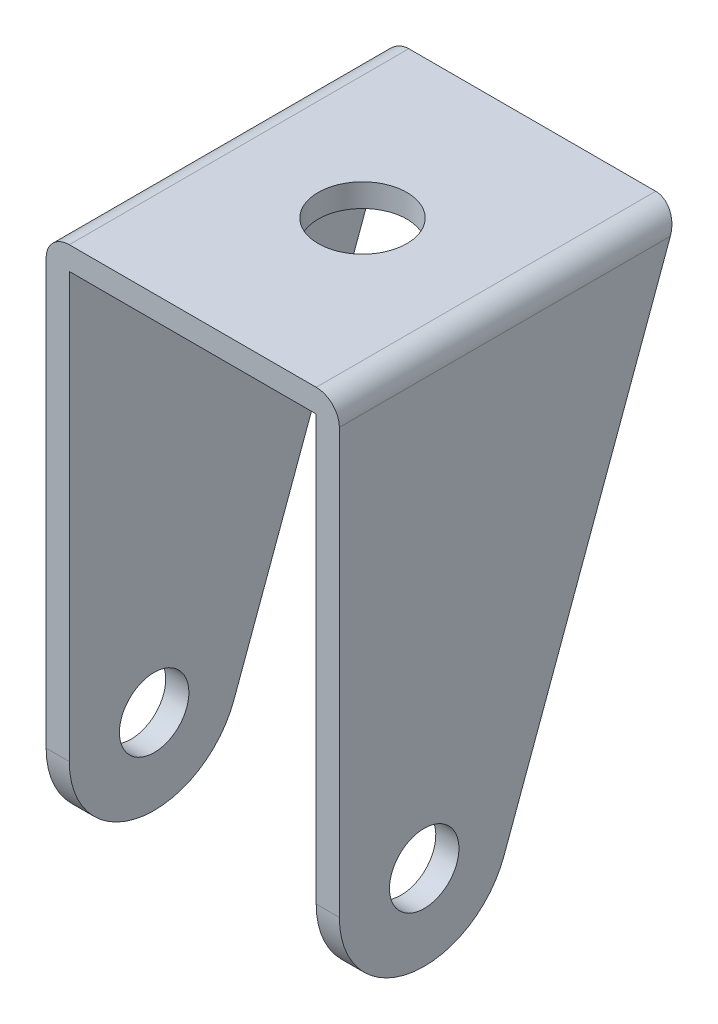
ISO-10303-21;
HEADER;
FILE_DESCRIPTION(('STEP AP214'),'2;1');
FILE_NAME('part.step','',(''),(''),'','','');
FILE_SCHEMA(('AUTOMOTIVE_DESIGN { 1 0 10303 214 1 1 1 1 }'));
ENDSEC;
DATA;
#1=APPLICATION_CONTEXT('core data for automotive mechanical design processes');
#2=APPLICATION_PROTOCOL_DEFINITION('international standard','automotive_design',2000,#1);
#3=PRODUCT_CONTEXT('',#1,'mechanical');
#4=PRODUCT('Part','Part','',(#3));
#5=PRODUCT_RELATED_PRODUCT_CATEGORY('part','',(#4));
#6=PRODUCT_DEFINITION_FORMATION('','',#4);
#7=PRODUCT_DEFINITION_CONTEXT('part definition',#1,'design');
#8=PRODUCT_DEFINITION('design','',#6,#7);
#9=PRODUCT_DEFINITION_SHAPE('','',#8);
#10=(LENGTH_UNIT() NAMED_UNIT(*) SI_UNIT(.MILLI.,.METRE.));
#11=(NAMED_UNIT(*) PLANE_ANGLE_UNIT() SI_UNIT($,.RADIAN.));
#12=(NAMED_UNIT(*) SI_UNIT($,.STERADIAN.) SOLID_ANGLE_UNIT());
#13=UNCERTAINTY_MEASURE_WITH_UNIT(LENGTH_MEASURE(1.E-05),#10,'distance_accuracy_value','');
#14=(GEOMETRIC_REPRESENTATION_CONTEXT(3) GLOBAL_UNCERTAINTY_ASSIGNED_CONTEXT((#13)) GLOBAL_UNIT_ASSIGNED_CONTEXT((#10,
#11,#12)) REPRESENTATION_CONTEXT('',''));
#15=CARTESIAN_POINT('',(0.,0.,0.));
#16=DIRECTION('',(0.,0.,1.));
#17=DIRECTION('',(1.,0.,0.));
#18=AXIS2_PLACEMENT_3D('',#15,#16,#17);
#19=CARTESIAN_POINT('',(19.,0.,0.));
#20=DIRECTION('',(-1.,0.,0.));
#21=DIRECTION('',(0.,0.,1.));
#22=AXIS2_PLACEMENT_3D('',#19,#20,#21);
#23=CYLINDRICAL_SURFACE('',#22,11.);
#24=DIRECTION('',(-1.,0.,0.));
#25=VECTOR('',#24,1.);
#26=CARTESIAN_POINT('',(19.,-3.78933501899957,-10.3267100333932));
#27=LINE('',#26,#25);
#28=CARTESIAN_POINT('',(-16.,-3.78933501899956,-10.3267100333932));
#29=VERTEX_POINT('',#28);
#30=CARTESIAN_POINT('',(-19.,-3.78933501899957,-10.3267100333932));
#31=VERTEX_POINT('',#30);
#32=EDGE_CURVE('E122',#29,#31,#27,.T.);
#33=ORIENTED_EDGE('',*,*,#32,.F.);
#34=CARTESIAN_POINT('',(-16.,0.,0.));
#35=DIRECTION('',(-1.,0.,0.));
#36=DIRECTION('',(0.,0.,1.));
#37=AXIS2_PLACEMENT_3D('',#34,#35,#36);
#38=CIRCLE('',#37,11.);
#39=CARTESIAN_POINT('',(-16.,0.,11.));
#40=VERTEX_POINT('',#39);
#41=EDGE_CURVE('E116',#29,#40,#38,.T.);
#42=ORIENTED_EDGE('',*,*,#41,.T.);
#43=DIRECTION('',(-1.,0.,0.));
#44=VECTOR('',#43,1.);
#45=CARTESIAN_POINT('',(19.,0.,11.));
#46=LINE('',#45,#44);
#47=CARTESIAN_POINT('',(-19.,0.,11.));
#48=VERTEX_POINT('',#47);
#49=EDGE_CURVE('E120',#40,#48,#46,.T.);
#50=ORIENTED_EDGE('',*,*,#49,.T.);
#51=CARTESIAN_POINT('',(-19.,0.,0.));
#52=DIRECTION('',(1.,0.,0.));
#53=DIRECTION('',(0.,0.,-1.));
#54=AXIS2_PLACEMENT_3D('',#51,#52,#53);
#55=CIRCLE('',#54,11.);
#56=EDGE_CURVE('E195',#48,#31,#55,.T.);
#57=ORIENTED_EDGE('',*,*,#56,.T.);
#58=EDGE_LOOP('',(#33,#42,#50,#57));
#59=FACE_BOUND('',#58,.T.);
#60=ADVANCED_FACE('F37',(#59),#23,.T.);
#61=CARTESIAN_POINT('',(19.,0.,11.));
#62=DIRECTION('',(0.,0.,-1.));
#63=DIRECTION('',(-1.,0.,0.));
#64=AXIS2_PLACEMENT_3D('',#61,#62,#63);
#65=PLANE('',#64);
#66=DIRECTION('',(0.,-1.,0.));
#67=VECTOR('',#66,1.);
#68=CARTESIAN_POINT('',(19.,0.,11.));
#69=LINE('',#68,#67);
#70=CARTESIAN_POINT('',(19.,55.,11.));
#71=VERTEX_POINT('',#70);
#72=CARTESIAN_POINT('',(19.,0.,11.));
#73=VERTEX_POINT('',#72);
#74=EDGE_CURVE('E142',#71,#73,#69,.T.);
#75=ORIENTED_EDGE('',*,*,#74,.F.);
#76=CARTESIAN_POINT('',(16.,55.,11.));
#77=DIRECTION('',(0.,0.,-1.));
#78=DIRECTION('',(-1.,0.,0.));
#79=AXIS2_PLACEMENT_3D('',#76,#77,#78);
#80=CIRCLE('',#79,3.);
#81=CARTESIAN_POINT('',(16.,58.,11.));
#82=VERTEX_POINT('',#81);
#83=EDGE_CURVE('E167',#71,#82,#80,.F.);
#84=ORIENTED_EDGE('',*,*,#83,.T.);
#85=DIRECTION('',(-1.,0.,0.));
#86=VECTOR('',#85,1.);
#87=CARTESIAN_POINT('',(19.,58.,11.));
#88=LINE('',#87,#86);
#89=CARTESIAN_POINT('',(-16.,58.,11.));
#90=VERTEX_POINT('',#89);
#91=EDGE_CURVE('E145',#82,#90,#88,.T.);
#92=ORIENTED_EDGE('',*,*,#91,.T.);
#93=CARTESIAN_POINT('',(-16.,55.,11.));
#94=DIRECTION('',(0.,0.,-1.));
#95=DIRECTION('',(-1.,0.,0.));
#96=AXIS2_PLACEMENT_3D('',#93,#94,#95);
#97=CIRCLE('',#96,3.);
#98=CARTESIAN_POINT('',(-19.,55.,11.));
#99=VERTEX_POINT('',#98);
#100=EDGE_CURVE('E165',#90,#99,#97,.F.);
#101=ORIENTED_EDGE('',*,*,#100,.T.);
#102=DIRECTION('',(0.,-1.,0.));
#103=VECTOR('',#102,1.);
#104=CARTESIAN_POINT('',(-19.,0.,11.));
#105=LINE('',#104,#103);
#106=EDGE_CURVE('E140',#99,#48,#105,.T.);
#107=ORIENTED_EDGE('',*,*,#106,.T.);
#108=ORIENTED_EDGE('',*,*,#49,.F.);
#109=DIRECTION('',(0.,-1.,0.));
#110=VECTOR('',#109,1.);
#111=CARTESIAN_POINT('',(-16.,0.,11.));
#112=LINE('',#111,#110);
#113=CARTESIAN_POINT('',(-16.,55.,11.));
#114=VERTEX_POINT('',#113);
#115=EDGE_CURVE('E129',#114,#40,#112,.T.);
#116=ORIENTED_EDGE('',*,*,#115,.F.);
#117=DIRECTION('',(-1.,0.,0.));
#118=VECTOR('',#117,1.);
#119=CARTESIAN_POINT('',(0.,55.,11.));
#120=LINE('',#119,#118);
#121=CARTESIAN_POINT('',(16.,55.,11.));
#122=VERTEX_POINT('',#121);
#123=EDGE_CURVE('E136',#122,#114,#120,.T.);
#124=ORIENTED_EDGE('',*,*,#123,.F.);
#125=DIRECTION('',(0.,-1.,0.));
#126=VECTOR('',#125,1.);
#127=CARTESIAN_POINT('',(16.,0.,11.));
#128=LINE('',#127,#126);
#129=CARTESIAN_POINT('',(16.,0.,11.));
#130=VERTEX_POINT('',#129);
#131=EDGE_CURVE('E135',#122,#130,#128,.T.);
#132=ORIENTED_EDGE('',*,*,#131,.T.);
#133=EDGE_CURVE('E141',#73,#130,#46,.T.);
#134=ORIENTED_EDGE('',*,*,#133,.F.);
#135=EDGE_LOOP('',(#75,#84,#92,#101,#107,#108,#116,#124,#132,#134));
#136=FACE_BOUND('',#135,.T.);
#137=ADVANCED_FACE('F139',(#136),#65,.F.);
#138=ORIENTED_EDGE('',*,*,#133,.T.);
#139=CARTESIAN_POINT('',(16.,0.,0.));
#140=DIRECTION('',(1.,0.,0.));
#141=DIRECTION('',(0.,0.,-1.));
#142=AXIS2_PLACEMENT_3D('',#139,#140,#141);
#143=CIRCLE('',#142,11.);
#144=CARTESIAN_POINT('',(16.,-3.78933501899956,-10.3267100333932));
#145=VERTEX_POINT('',#144);
#146=EDGE_CURVE('E124',#130,#145,#143,.T.);
#147=ORIENTED_EDGE('',*,*,#146,.T.);
#148=CARTESIAN_POINT('',(19.,-3.78933501899957,-10.3267100333932));
#149=VERTEX_POINT('',#148);
#150=EDGE_CURVE('E155',#149,#145,#27,.T.);
#151=ORIENTED_EDGE('',*,*,#150,.F.);
#152=CARTESIAN_POINT('',(19.,0.,0.));
#153=DIRECTION('',(1.,0.,0.));
#154=DIRECTION('',(0.,0.,-1.));
#155=AXIS2_PLACEMENT_3D('',#152,#153,#154);
#156=CIRCLE('',#155,11.);
#157=EDGE_CURVE('E184',#73,#149,#156,.T.);
#158=ORIENTED_EDGE('',*,*,#157,.F.);
#159=EDGE_LOOP('',(#138,#147,#151,#158));
#160=FACE_BOUND('',#159,.T.);
#161=ADVANCED_FACE('F240',(#160),#23,.T.);
#162=CARTESIAN_POINT('',(19.,58.,-33.));
#163=DIRECTION('',(0.,0.344485001727234,0.938791821217562));
#164=DIRECTION('',(0.,-0.938791821217563,0.344485001727234));
#165=AXIS2_PLACEMENT_3D('',#162,#163,#164);
#166=PLANE('',#165);
#167=DIRECTION('',(-1.,0.,0.));
#168=VECTOR('',#167,1.);
#169=CARTESIAN_POINT('',(19.,58.,-33.));
#170=LINE('',#169,#168);
#171=CARTESIAN_POINT('',(16.,58.,-33.));
#172=VERTEX_POINT('',#171);
#173=CARTESIAN_POINT('',(-16.,58.,-33.));
#174=VERTEX_POINT('',#173);
#175=EDGE_CURVE('E153',#172,#174,#170,.T.);
#176=ORIENTED_EDGE('',*,*,#175,.F.);
#177=CARTESIAN_POINT('',(16.,55.,-31.8991648821127));
#178=DIRECTION('',(0.,0.344485001727234,0.938791821217562));
#179=DIRECTION('',(0.,0.938791821217563,-0.344485001727234));
#180=AXIS2_PLACEMENT_3D('',#177,#178,#179);
#181=ELLIPSE('',#180,3.19559665113951,3.);
#182=CARTESIAN_POINT('',(19.,55.,-31.8991648821127));
#183=VERTEX_POINT('',#182);
#184=EDGE_CURVE('E45',#172,#183,#181,.F.);
#185=ORIENTED_EDGE('',*,*,#184,.T.);
#186=DIRECTION('',(0.,0.938791821217563,-0.344485001727234));
#187=VECTOR('',#186,1.);
#188=CARTESIAN_POINT('',(19.,58.,-33.));
#189=LINE('',#188,#187);
#190=EDGE_CURVE('E146',#149,#183,#189,.T.);
#191=ORIENTED_EDGE('',*,*,#190,.F.);
#192=ORIENTED_EDGE('',*,*,#150,.T.);
#193=DIRECTION('',(0.,-0.938791821217563,0.344485001727234));
#194=VECTOR('',#193,1.);
#195=CARTESIAN_POINT('',(16.,58.,-33.));
#196=LINE('',#195,#194);
#197=CARTESIAN_POINT('',(16.,55.,-31.8991648821127));
#198=VERTEX_POINT('',#197);
#199=EDGE_CURVE('E203',#198,#145,#196,.T.);
#200=ORIENTED_EDGE('',*,*,#199,.F.);
#201=DIRECTION('',(-1.,0.,0.));
#202=VECTOR('',#201,1.);
#203=CARTESIAN_POINT('',(19.,55.,-31.8991648821127));
#204=LINE('',#203,#202);
#205=CARTESIAN_POINT('',(-16.,55.,-31.8991648821127));
#206=VERTEX_POINT('',#205);
#207=EDGE_CURVE('E198',#198,#206,#204,.T.);
#208=ORIENTED_EDGE('',*,*,#207,.T.);
#209=DIRECTION('',(0.,-0.938791821217563,0.344485001727234));
#210=VECTOR('',#209,1.);
#211=CARTESIAN_POINT('',(-16.,58.,-33.));
#212=LINE('',#211,#210);
#213=EDGE_CURVE('E206',#206,#29,#212,.T.);
#214=ORIENTED_EDGE('',*,*,#213,.T.);
#215=ORIENTED_EDGE('',*,*,#32,.T.);
#216=DIRECTION('',(0.,0.938791821217563,-0.344485001727234));
#217=VECTOR('',#216,1.);
#218=CARTESIAN_POINT('',(-19.,58.,-33.));
#219=LINE('',#218,#217);
#220=CARTESIAN_POINT('',(-19.,55.,-31.8991648821127));
#221=VERTEX_POINT('',#220);
#222=EDGE_CURVE('E196',#31,#221,#219,.T.);
#223=ORIENTED_EDGE('',*,*,#222,.T.);
#224=CARTESIAN_POINT('',(-16.,55.,-31.8991648821127));
#225=DIRECTION('',(0.,0.344485001727234,0.938791821217562));
#226=DIRECTION('',(0.,-0.938791821217563,0.344485001727234));
#227=AXIS2_PLACEMENT_3D('',#224,#225,#226);
#228=ELLIPSE('',#227,3.19559665113951,3.);
#229=EDGE_CURVE('E57',#221,#174,#228,.F.);
#230=ORIENTED_EDGE('',*,*,#229,.T.);
#231=EDGE_LOOP('',(#176,#185,#191,#192,#200,#208,#214,#215,#223,#230));
#232=FACE_BOUND('',#231,.T.);
#233=ADVANCED_FACE('F176',(#232),#166,.F.);
#234=CARTESIAN_POINT('',(19.,58.,11.));
#235=DIRECTION('',(0.,-1.,0.));
#236=DIRECTION('',(0.,0.,-1.));
#237=AXIS2_PLACEMENT_3D('',#234,#235,#236);
#238=PLANE('',#237);
#239=CARTESIAN_POINT('',(0.,58.,-11.));
#240=DIRECTION('',(0.,1.,0.));
#241=DIRECTION('',(0.,0.,1.));
#242=AXIS2_PLACEMENT_3D('',#239,#240,#241);
#243=CIRCLE('',#242,5.75);
#244=CARTESIAN_POINT('',(0.,58.,-5.25));
#245=VERTEX_POINT('',#244);
#246=EDGE_CURVE('E225',#245,#245,#243,.T.);
#247=ORIENTED_EDGE('',*,*,#246,.F.);
#248=EDGE_LOOP('',(#247));
#249=FACE_BOUND('',#248,.T.);
#250=ORIENTED_EDGE('',*,*,#91,.F.);
#251=DIRECTION('',(0.,0.,1.));
#252=VECTOR('',#251,1.);
#253=CARTESIAN_POINT('',(16.,58.,-33.));
#254=LINE('',#253,#252);
#255=EDGE_CURVE('E172',#82,#172,#254,.F.);
#256=ORIENTED_EDGE('',*,*,#255,.T.);
#257=ORIENTED_EDGE('',*,*,#175,.T.);
#258=DIRECTION('',(0.,0.,1.));
#259=VECTOR('',#258,1.);
#260=CARTESIAN_POINT('',(-16.,58.,11.));
#261=LINE('',#260,#259);
#262=EDGE_CURVE('E169',#174,#90,#261,.T.);
#263=ORIENTED_EDGE('',*,*,#262,.T.);
#264=EDGE_LOOP('',(#250,#256,#257,#263));
#265=FACE_BOUND('',#264,.T.);
#266=ADVANCED_FACE('F191',(#249,#265),#238,.F.);
#267=CARTESIAN_POINT('',(19.,0.,0.));
#268=DIRECTION('',(1.,0.,0.));
#269=DIRECTION('',(0.,0.,-1.));
#270=AXIS2_PLACEMENT_3D('',#267,#268,#269);
#271=PLANE('',#270);
#272=CARTESIAN_POINT('',(19.,0.,0.));
#273=DIRECTION('',(-1.,0.,0.));
#274=DIRECTION('',(0.,0.,1.));
#275=AXIS2_PLACEMENT_3D('',#272,#273,#274);
#276=CIRCLE('',#275,4.5);
#277=CARTESIAN_POINT('',(19.,0.,4.5));
#278=VERTEX_POINT('',#277);
#279=EDGE_CURVE('E162',#278,#278,#276,.T.);
#280=ORIENTED_EDGE('',*,*,#279,.T.);
#281=EDGE_LOOP('',(#280));
#282=FACE_BOUND('',#281,.T.);
#283=ORIENTED_EDGE('',*,*,#190,.T.);
#284=DIRECTION('',(0.,0.,1.));
#285=VECTOR('',#284,1.);
#286=CARTESIAN_POINT('',(19.,55.,11.));
#287=LINE('',#286,#285);
#288=EDGE_CURVE('E158',#183,#71,#287,.T.);
#289=ORIENTED_EDGE('',*,*,#288,.T.);
#290=ORIENTED_EDGE('',*,*,#74,.T.);
#291=ORIENTED_EDGE('',*,*,#157,.T.);
#292=EDGE_LOOP('',(#283,#289,#290,#291));
#293=FACE_BOUND('',#292,.T.);
#294=ADVANCED_FACE('F182',(#282,#293),#271,.T.);
#295=CARTESIAN_POINT('',(-19.,0.,0.));
#296=DIRECTION('',(1.,0.,0.));
#297=DIRECTION('',(0.,0.,-1.));
#298=AXIS2_PLACEMENT_3D('',#295,#296,#297);
#299=PLANE('',#298);
#300=CARTESIAN_POINT('',(-19.,0.,0.));
#301=DIRECTION('',(-1.,0.,0.));
#302=DIRECTION('',(0.,0.,1.));
#303=AXIS2_PLACEMENT_3D('',#300,#301,#302);
#304=CIRCLE('',#303,4.5);
#305=CARTESIAN_POINT('',(-19.,0.,4.5));
#306=VERTEX_POINT('',#305);
#307=EDGE_CURVE('E217',#306,#306,#304,.T.);
#308=ORIENTED_EDGE('',*,*,#307,.F.);
#309=EDGE_LOOP('',(#308));
#310=FACE_BOUND('',#309,.T.);
#311=ORIENTED_EDGE('',*,*,#106,.F.);
#312=DIRECTION('',(0.,0.,1.));
#313=VECTOR('',#312,1.);
#314=CARTESIAN_POINT('',(-19.,55.,0.));
#315=LINE('',#314,#313);
#316=EDGE_CURVE('E11',#99,#221,#315,.F.);
#317=ORIENTED_EDGE('',*,*,#316,.T.);
#318=ORIENTED_EDGE('',*,*,#222,.F.);
#319=ORIENTED_EDGE('',*,*,#56,.F.);
#320=EDGE_LOOP('',(#311,#317,#318,#319));
#321=FACE_BOUND('',#320,.T.);
#322=ADVANCED_FACE('F194',(#310,#321),#299,.F.);
#323=CARTESIAN_POINT('',(0.,55.,-33.));
#324=DIRECTION('',(0.,1.,0.));
#325=DIRECTION('',(-1.,0.,0.));
#326=AXIS2_PLACEMENT_3D('',#323,#324,#325);
#327=PLANE('',#326);
#328=CARTESIAN_POINT('',(0.,55.,-11.));
#329=DIRECTION('',(0.,1.,0.));
#330=DIRECTION('',(-1.,0.,0.));
#331=AXIS2_PLACEMENT_3D('',#328,#329,#330);
#332=CIRCLE('',#331,5.75);
#333=CARTESIAN_POINT('',(-5.75,55.,-11.));
#334=VERTEX_POINT('',#333);
#335=EDGE_CURVE('E220',#334,#334,#332,.F.);
#336=ORIENTED_EDGE('',*,*,#335,.F.);
#337=EDGE_LOOP('',(#336));
#338=FACE_BOUND('',#337,.T.);
#339=DIRECTION('',(0.,0.,1.));
#340=VECTOR('',#339,1.);
#341=CARTESIAN_POINT('',(16.,55.,-33.));
#342=LINE('',#341,#340);
#343=EDGE_CURVE('E208',#198,#122,#342,.T.);
#344=ORIENTED_EDGE('',*,*,#343,.T.);
#345=ORIENTED_EDGE('',*,*,#123,.T.);
#346=DIRECTION('',(0.,0.,1.));
#347=VECTOR('',#346,1.);
#348=CARTESIAN_POINT('',(-16.,55.,-33.));
#349=LINE('',#348,#347);
#350=EDGE_CURVE('E132',#206,#114,#349,.T.);
#351=ORIENTED_EDGE('',*,*,#350,.F.);
#352=ORIENTED_EDGE('',*,*,#207,.F.);
#353=EDGE_LOOP('',(#344,#345,#351,#352));
#354=FACE_BOUND('',#353,.T.);
#355=ADVANCED_FACE('F258',(#338,#354),#327,.F.);
#356=CARTESIAN_POINT('',(16.,0.,-33.));
#357=DIRECTION('',(-1.,0.,0.));
#358=DIRECTION('',(0.,-1.,0.));
#359=AXIS2_PLACEMENT_3D('',#356,#357,#358);
#360=PLANE('',#359);
#361=CARTESIAN_POINT('',(16.,0.,0.));
#362=DIRECTION('',(-1.,0.,0.));
#363=DIRECTION('',(0.,-1.,0.));
#364=AXIS2_PLACEMENT_3D('',#361,#362,#363);
#365=CIRCLE('',#364,4.5);
#366=CARTESIAN_POINT('',(16.,-4.5,0.));
#367=VERTEX_POINT('',#366);
#368=EDGE_CURVE('E125',#367,#367,#365,.T.);
#369=ORIENTED_EDGE('',*,*,#368,.F.);
#370=EDGE_LOOP('',(#369));
#371=FACE_BOUND('',#370,.T.);
#372=ORIENTED_EDGE('',*,*,#199,.T.);
#373=ORIENTED_EDGE('',*,*,#146,.F.);
#374=ORIENTED_EDGE('',*,*,#131,.F.);
#375=ORIENTED_EDGE('',*,*,#343,.F.);
#376=EDGE_LOOP('',(#372,#373,#374,#375));
#377=FACE_BOUND('',#376,.T.);
#378=ADVANCED_FACE('F255',(#371,#377),#360,.T.);
#379=CARTESIAN_POINT('',(-16.,0.,-33.));
#380=DIRECTION('',(-1.,0.,0.));
#381=DIRECTION('',(0.,-1.,0.));
#382=AXIS2_PLACEMENT_3D('',#379,#380,#381);
#383=PLANE('',#382);
#384=CARTESIAN_POINT('',(-16.,0.,0.));
#385=DIRECTION('',(-1.,0.,0.));
#386=DIRECTION('',(0.,-1.,0.));
#387=AXIS2_PLACEMENT_3D('',#384,#385,#386);
#388=CIRCLE('',#387,4.5);
#389=CARTESIAN_POINT('',(-16.,-4.5,0.));
#390=VERTEX_POINT('',#389);
#391=EDGE_CURVE('E159',#390,#390,#388,.T.);
#392=ORIENTED_EDGE('',*,*,#391,.T.);
#393=EDGE_LOOP('',(#392));
#394=FACE_BOUND('',#393,.T.);
#395=ORIENTED_EDGE('',*,*,#350,.T.);
#396=ORIENTED_EDGE('',*,*,#115,.T.);
#397=ORIENTED_EDGE('',*,*,#41,.F.);
#398=ORIENTED_EDGE('',*,*,#213,.F.);
#399=EDGE_LOOP('',(#395,#396,#397,#398));
#400=FACE_BOUND('',#399,.T.);
#401=ADVANCED_FACE('F130',(#394,#400),#383,.F.);
#402=CARTESIAN_POINT('',(19.,0.,0.));
#403=DIRECTION('',(-1.,0.,0.));
#404=DIRECTION('',(0.,0.,1.));
#405=AXIS2_PLACEMENT_3D('',#402,#403,#404);
#406=CYLINDRICAL_SURFACE('',#405,4.5);
#407=ORIENTED_EDGE('',*,*,#307,.T.);
#408=EDGE_LOOP('',(#407));
#409=FACE_BOUND('',#408,.T.);
#410=ORIENTED_EDGE('',*,*,#391,.F.);
#411=EDGE_LOOP('',(#410));
#412=FACE_BOUND('',#411,.T.);
#413=ADVANCED_FACE('F273',(#409,#412),#406,.F.);
#414=ORIENTED_EDGE('',*,*,#368,.T.);
#415=EDGE_LOOP('',(#414));
#416=FACE_BOUND('',#415,.T.);
#417=ORIENTED_EDGE('',*,*,#279,.F.);
#418=EDGE_LOOP('',(#417));
#419=FACE_BOUND('',#418,.T.);
#420=ADVANCED_FACE('F276',(#416,#419),#406,.F.);
#421=CARTESIAN_POINT('',(0.,-11.001,-11.));
#422=DIRECTION('',(0.,1.,0.));
#423=DIRECTION('',(0.,0.,1.));
#424=AXIS2_PLACEMENT_3D('',#421,#422,#423);
#425=CYLINDRICAL_SURFACE('',#424,5.75);
#426=ORIENTED_EDGE('',*,*,#246,.T.);
#427=EDGE_LOOP('',(#426));
#428=FACE_BOUND('',#427,.T.);
#429=ORIENTED_EDGE('',*,*,#335,.T.);
#430=EDGE_LOOP('',(#429));
#431=FACE_BOUND('',#430,.T.);
#432=ADVANCED_FACE('F229',(#428,#431),#425,.F.);
#433=CARTESIAN_POINT('',(16.,55.,0.));
#434=DIRECTION('',(0.,0.,-1.));
#435=DIRECTION('',(-1.,0.,0.));
#436=AXIS2_PLACEMENT_3D('',#433,#434,#435);
#437=CYLINDRICAL_SURFACE('',#436,3.);
#438=ORIENTED_EDGE('',*,*,#184,.F.);
#439=ORIENTED_EDGE('',*,*,#255,.F.);
#440=ORIENTED_EDGE('',*,*,#83,.F.);
#441=ORIENTED_EDGE('',*,*,#288,.F.);
#442=EDGE_LOOP('',(#438,#439,#440,#441));
#443=FACE_BOUND('',#442,.T.);
#444=ADVANCED_FACE('F187',(#443),#437,.T.);
#445=CARTESIAN_POINT('',(-16.,55.,11.));
#446=DIRECTION('',(0.,0.,1.));
#447=DIRECTION('',(1.,0.,0.));
#448=AXIS2_PLACEMENT_3D('',#445,#446,#447);
#449=CYLINDRICAL_SURFACE('',#448,3.);
#450=ORIENTED_EDGE('',*,*,#229,.F.);
#451=ORIENTED_EDGE('',*,*,#316,.F.);
#452=ORIENTED_EDGE('',*,*,#100,.F.);
#453=ORIENTED_EDGE('',*,*,#262,.F.);
#454=EDGE_LOOP('',(#450,#451,#452,#453));
#455=FACE_BOUND('',#454,.T.);
#456=ADVANCED_FACE('F39',(#455),#449,.T.);
#457=CLOSED_SHELL('',(#60,#137,#161,#233,#266,#294,#322,#355,#378,#401,#413,#420,#432,#444,#456));
#458=MANIFOLD_SOLID_BREP('B2',#457);
#459=ADVANCED_BREP_SHAPE_REPRESENTATION('',(#18,#458),#14);
#460=SHAPE_DEFINITION_REPRESENTATION(#9,#459);
ENDSEC;
END-ISO-10303-21;
